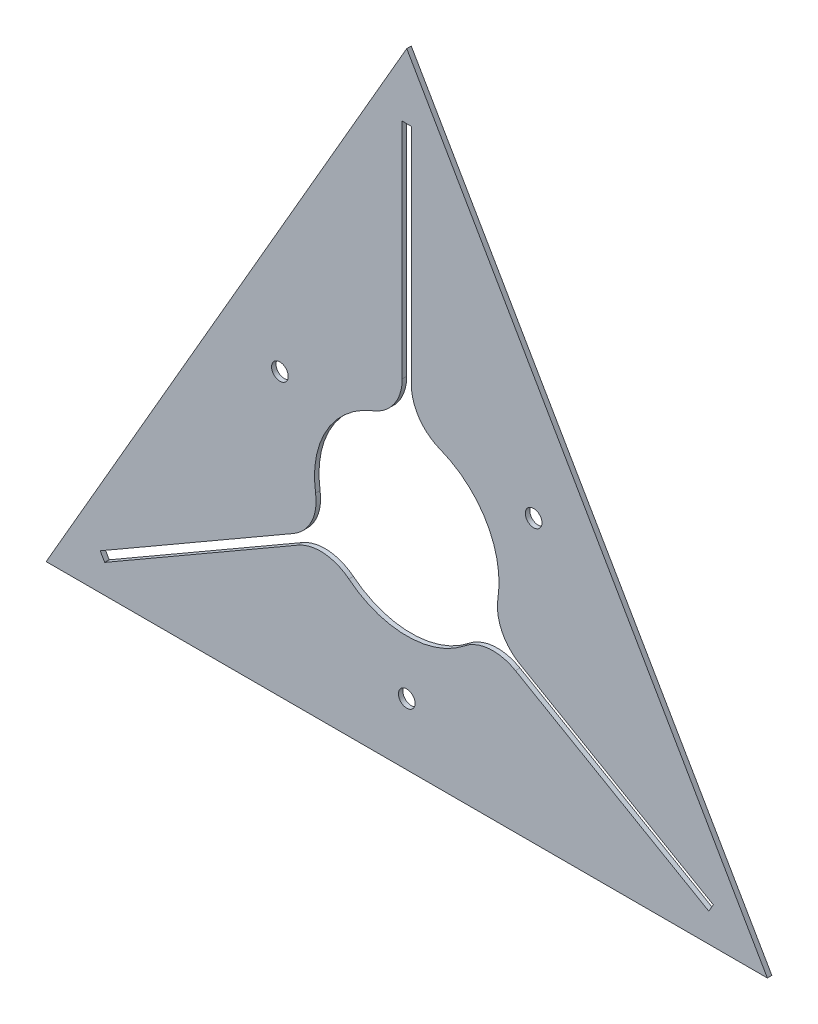
ISO-10303-21;
HEADER;
FILE_DESCRIPTION(('STEP AP214'),'2;1');
FILE_NAME('part.step','',(''),(''),'','','');
FILE_SCHEMA(('AUTOMOTIVE_DESIGN { 1 0 10303 214 1 1 1 1 }'));
ENDSEC;
DATA;
#1=APPLICATION_CONTEXT('core data for automotive mechanical design processes');
#2=APPLICATION_PROTOCOL_DEFINITION('international standard','automotive_design',2000,#1);
#3=PRODUCT_CONTEXT('',#1,'mechanical');
#4=PRODUCT('Part','Part','',(#3));
#5=PRODUCT_RELATED_PRODUCT_CATEGORY('part','',(#4));
#6=PRODUCT_DEFINITION_FORMATION('','',#4);
#7=PRODUCT_DEFINITION_CONTEXT('part definition',#1,'design');
#8=PRODUCT_DEFINITION('design','',#6,#7);
#9=PRODUCT_DEFINITION_SHAPE('','',#8);
#10=(LENGTH_UNIT() NAMED_UNIT(*) SI_UNIT(.MILLI.,.METRE.));
#11=(NAMED_UNIT(*) PLANE_ANGLE_UNIT() SI_UNIT($,.RADIAN.));
#12=(NAMED_UNIT(*) SI_UNIT($,.STERADIAN.) SOLID_ANGLE_UNIT());
#13=UNCERTAINTY_MEASURE_WITH_UNIT(LENGTH_MEASURE(1.E-05),#10,'distance_accuracy_value','');
#14=(GEOMETRIC_REPRESENTATION_CONTEXT(3) GLOBAL_UNCERTAINTY_ASSIGNED_CONTEXT((#13)) GLOBAL_UNIT_ASSIGNED_CONTEXT((#10,
#11,#12)) REPRESENTATION_CONTEXT('',''));
#15=CARTESIAN_POINT('',(0.,0.,0.));
#16=DIRECTION('',(0.,0.,1.));
#17=DIRECTION('',(1.,0.,0.));
#18=AXIS2_PLACEMENT_3D('',#15,#16,#17);
#19=CARTESIAN_POINT('',(0.,0.,2.54));
#20=DIRECTION('',(0.,0.,1.));
#21=DIRECTION('',(1.,0.,0.));
#22=AXIS2_PLACEMENT_3D('',#19,#20,#21);
#23=PLANE('',#22);
#24=CARTESIAN_POINT('',(-71.4903970824054,41.275,2.54));
#25=DIRECTION('',(0.,0.,1.));
#26=DIRECTION('',(1.,0.,0.));
#27=AXIS2_PLACEMENT_3D('',#24,#25,#26);
#28=CIRCLE('',#27,4.69899999999999);
#29=CARTESIAN_POINT('',(-66.7913970824054,41.275,2.54));
#30=VERTEX_POINT('',#29);
#31=EDGE_CURVE('E457',#30,#30,#28,.T.);
#32=ORIENTED_EDGE('',*,*,#31,.F.);
#33=EDGE_LOOP('',(#32));
#34=FACE_BOUND('',#33,.T.);
#35=DIRECTION('',(0.,-1.,0.));
#36=VECTOR('',#35,1.);
#37=CARTESIAN_POINT('',(-2.53999999999989,72.1881059610931,2.54));
#38=LINE('',#37,#36);
#39=CARTESIAN_POINT('',(-2.54,197.994436104842,2.54));
#40=VERTEX_POINT('',#39);
#41=CARTESIAN_POINT('',(-2.53999999999989,72.1881059610931,2.54));
#42=VERTEX_POINT('',#41);
#43=EDGE_CURVE('E188',#40,#42,#38,.T.);
#44=ORIENTED_EDGE('',*,*,#43,.F.);
#45=DIRECTION('',(-1.,0.,0.));
#46=VECTOR('',#45,1.);
#47=CARTESIAN_POINT('',(-2.54,197.994436104842,2.54));
#48=LINE('',#47,#46);
#49=CARTESIAN_POINT('',(2.54,197.994436104842,2.54));
#50=VERTEX_POINT('',#49);
#51=EDGE_CURVE('E180',#50,#40,#48,.T.);
#52=ORIENTED_EDGE('',*,*,#51,.F.);
#53=DIRECTION('',(0.,1.,0.));
#54=VECTOR('',#53,1.);
#55=CARTESIAN_POINT('',(2.53999999999989,72.1881059610931,2.54));
#56=LINE('',#55,#54);
#57=CARTESIAN_POINT('',(2.53999999999989,72.1881059610931,2.54));
#58=VERTEX_POINT('',#57);
#59=EDGE_CURVE('E235',#58,#50,#56,.T.);
#60=ORIENTED_EDGE('',*,*,#59,.F.);
#61=CARTESIAN_POINT('',(27.9399999999999,72.1881059610931,2.54));
#62=DIRECTION('',(0.,0.,-1.));
#63=DIRECTION('',(1.,0.,0.));
#64=AXIS2_PLACEMENT_3D('',#61,#62,#63);
#65=CIRCLE('',#64,25.4);
#66=CARTESIAN_POINT('',(18.7718293683346,48.5004583938763,2.54));
#67=VERTEX_POINT('',#66);
#68=EDGE_CURVE('E233',#67,#58,#65,.T.);
#69=ORIENTED_EDGE('',*,*,#68,.F.);
#70=CARTESIAN_POINT('',(0.,0.,2.54));
#71=DIRECTION('',(0.,0.,1.));
#72=DIRECTION('',(1.,0.,0.));
#73=AXIS2_PLACEMENT_3D('',#70,#71,#72);
#74=CIRCLE('',#73,52.0065);
#75=CARTESIAN_POINT('',(51.3885437484545,-7.9933480884536,2.54));
#76=VERTEX_POINT('',#75);
#77=EDGE_CURVE('E231',#76,#67,#74,.T.);
#78=ORIENTED_EDGE('',*,*,#77,.F.);
#79=CARTESIAN_POINT('',(76.4867336133894,-11.8973031988095,2.54));
#80=DIRECTION('',(0.,0.,-1.));
#81=DIRECTION('',(1.,0.,0.));
#82=AXIS2_PLACEMENT_3D('',#79,#80,#81);
#83=CIRCLE('',#82,25.4);
#84=CARTESIAN_POINT('',(63.7867336133895,-33.8943484549342,2.54));
#85=VERTEX_POINT('',#84);
#86=EDGE_CURVE('E229',#85,#76,#83,.T.);
#87=ORIENTED_EDGE('',*,*,#86,.F.);
#88=DIRECTION('',(-0.866025403784439,0.499999999999999,0.));
#89=VECTOR('',#88,1.);
#90=CARTESIAN_POINT('',(63.7867336133895,-33.8943484549342,2.54));
#91=LINE('',#90,#89);
#92=CARTESIAN_POINT('',(172.738211474768,-96.7975135268084,2.54));
#93=VERTEX_POINT('',#92);
#94=EDGE_CURVE('E227',#93,#85,#91,.T.);
#95=ORIENTED_EDGE('',*,*,#94,.F.);
#96=DIRECTION('',(0.500000000000002,0.866025403784437,0.));
#97=VECTOR('',#96,1.);
#98=CARTESIAN_POINT('',(172.738211474768,-96.7975135268084,2.54));
#99=LINE('',#98,#97);
#100=CARTESIAN_POINT('',(170.198211474768,-101.196922578033,2.54));
#101=VERTEX_POINT('',#100);
#102=EDGE_CURVE('E225',#101,#93,#99,.T.);
#103=ORIENTED_EDGE('',*,*,#102,.F.);
#104=DIRECTION('',(0.866025403784438,-0.5,0.));
#105=VECTOR('',#104,1.);
#106=CARTESIAN_POINT('',(61.2467336133896,-38.2937575061589,2.54));
#107=LINE('',#106,#105);
#108=CARTESIAN_POINT('',(61.2467336133896,-38.2937575061589,2.54));
#109=VERTEX_POINT('',#108);
#110=EDGE_CURVE('E223',#109,#101,#107,.T.);
#111=ORIENTED_EDGE('',*,*,#110,.F.);
#112=CARTESIAN_POINT('',(48.5467336133896,-60.2908027622836,2.54));
#113=DIRECTION('',(0.,0.,-1.));
#114=DIRECTION('',(1.,0.,0.));
#115=AXIS2_PLACEMENT_3D('',#112,#113,#114);
#116=CIRCLE('',#115,25.4);
#117=CARTESIAN_POINT('',(32.6167143801198,-40.5071103054227,2.54));
#118=VERTEX_POINT('',#117);
#119=EDGE_CURVE('E221',#118,#109,#116,.T.);
#120=ORIENTED_EDGE('',*,*,#119,.F.);
#121=CARTESIAN_POINT('',(0.,0.,2.54));
#122=DIRECTION('',(0.,0.,1.));
#123=DIRECTION('',(1.,0.,0.));
#124=AXIS2_PLACEMENT_3D('',#121,#122,#123);
#125=CIRCLE('',#124,52.0065);
#126=CARTESIAN_POINT('',(-32.6167143801198,-40.5071103054228,2.54));
#127=VERTEX_POINT('',#126);
#128=EDGE_CURVE('E219',#127,#118,#125,.T.);
#129=ORIENTED_EDGE('',*,*,#128,.F.);
#130=CARTESIAN_POINT('',(-48.5467336133896,-60.2908027622837,2.54));
#131=DIRECTION('',(0.,0.,-1.));
#132=DIRECTION('',(1.,0.,0.));
#133=AXIS2_PLACEMENT_3D('',#130,#131,#132);
#134=CIRCLE('',#133,25.4);
#135=CARTESIAN_POINT('',(-61.2467336133896,-38.293757506159,2.54));
#136=VERTEX_POINT('',#135);
#137=EDGE_CURVE('E217',#136,#127,#134,.T.);
#138=ORIENTED_EDGE('',*,*,#137,.F.);
#139=DIRECTION('',(0.866025403784438,0.500000000000001,0.));
#140=VECTOR('',#139,1.);
#141=CARTESIAN_POINT('',(-61.2467336133896,-38.293757506159,2.54));
#142=LINE('',#141,#140);
#143=CARTESIAN_POINT('',(-170.198211474768,-101.196922578034,2.54));
#144=VERTEX_POINT('',#143);
#145=EDGE_CURVE('E215',#144,#136,#142,.T.);
#146=ORIENTED_EDGE('',*,*,#145,.F.);
#147=DIRECTION('',(0.500000000000002,-0.866025403784438,0.));
#148=VECTOR('',#147,1.);
#149=CARTESIAN_POINT('',(-170.198211474768,-101.196922578034,2.54));
#150=LINE('',#149,#148);
#151=CARTESIAN_POINT('',(-172.738211474768,-96.7975135268086,2.54));
#152=VERTEX_POINT('',#151);
#153=EDGE_CURVE('E213',#152,#144,#150,.T.);
#154=ORIENTED_EDGE('',*,*,#153,.F.);
#155=DIRECTION('',(-0.866025403784439,-0.5,0.));
#156=VECTOR('',#155,1.);
#157=CARTESIAN_POINT('',(-63.7867336133895,-33.8943484549342,2.54));
#158=LINE('',#157,#156);
#159=CARTESIAN_POINT('',(-63.7867336133895,-33.8943484549342,2.54));
#160=VERTEX_POINT('',#159);
#161=EDGE_CURVE('E211',#160,#152,#158,.T.);
#162=ORIENTED_EDGE('',*,*,#161,.F.);
#163=CARTESIAN_POINT('',(-76.4867336133894,-11.8973031988095,2.54));
#164=DIRECTION('',(0.,0.,-1.));
#165=DIRECTION('',(1.,0.,0.));
#166=AXIS2_PLACEMENT_3D('',#163,#164,#165);
#167=CIRCLE('',#166,25.4);
#168=CARTESIAN_POINT('',(-51.3885437484544,-7.99334808845362,2.54));
#169=VERTEX_POINT('',#168);
#170=EDGE_CURVE('E209',#169,#160,#167,.T.);
#171=ORIENTED_EDGE('',*,*,#170,.F.);
#172=CARTESIAN_POINT('',(0.,0.,2.54));
#173=DIRECTION('',(0.,0.,1.));
#174=DIRECTION('',(1.,0.,0.));
#175=AXIS2_PLACEMENT_3D('',#172,#173,#174);
#176=CIRCLE('',#175,52.0065);
#177=CARTESIAN_POINT('',(-18.7718293683346,48.5004583938764,2.54));
#178=VERTEX_POINT('',#177);
#179=EDGE_CURVE('E204',#178,#169,#176,.T.);
#180=ORIENTED_EDGE('',*,*,#179,.F.);
#181=CARTESIAN_POINT('',(-27.9399999999999,72.1881059610931,2.54));
#182=DIRECTION('',(0.,0.,-1.));
#183=DIRECTION('',(1.,0.,0.));
#184=AXIS2_PLACEMENT_3D('',#181,#182,#183);
#185=CIRCLE('',#184,25.4);
#186=EDGE_CURVE('E202',#42,#178,#185,.T.);
#187=ORIENTED_EDGE('',*,*,#186,.F.);
#188=EDGE_LOOP('',(#44,#52,#60,#69,#78,#87,#95,#103,#111,#120,#129,#138,#146,#154,#162,#171,
#180,#187));
#189=FACE_BOUND('',#188,.T.);
#190=DIRECTION('',(-0.5,0.866025403784439,0.));
#191=VECTOR('',#190,1.);
#192=CARTESIAN_POINT('',(203.2,-117.317574699332,2.54));
#193=LINE('',#192,#191);
#194=CARTESIAN_POINT('',(203.2,-117.317574699332,2.54));
#195=VERTEX_POINT('',#194);
#196=CARTESIAN_POINT('',(1.11022302462516E-13,234.635149398664,2.54));
#197=VERTEX_POINT('',#196);
#198=EDGE_CURVE('E318',#195,#197,#193,.T.);
#199=ORIENTED_EDGE('',*,*,#198,.T.);
#200=DIRECTION('',(-0.5,-0.866025403784438,0.));
#201=VECTOR('',#200,1.);
#202=CARTESIAN_POINT('',(1.11022302462516E-13,234.635149398664,2.54));
#203=LINE('',#202,#201);
#204=CARTESIAN_POINT('',(-203.2,-117.317574699332,2.54));
#205=VERTEX_POINT('',#204);
#206=EDGE_CURVE('E321',#197,#205,#203,.T.);
#207=ORIENTED_EDGE('',*,*,#206,.T.);
#208=DIRECTION('',(1.,0.,0.));
#209=VECTOR('',#208,1.);
#210=CARTESIAN_POINT('',(-203.2,-117.317574699332,2.54));
#211=LINE('',#210,#209);
#212=EDGE_CURVE('E324',#205,#195,#211,.T.);
#213=ORIENTED_EDGE('',*,*,#212,.T.);
#214=EDGE_LOOP('',(#199,#207,#213));
#215=FACE_BOUND('',#214,.T.);
#216=CARTESIAN_POINT('',(0.,-82.55,2.54));
#217=DIRECTION('',(0.,0.,1.));
#218=DIRECTION('',(1.,0.,0.));
#219=AXIS2_PLACEMENT_3D('',#216,#217,#218);
#220=CIRCLE('',#219,4.699);
#221=CARTESIAN_POINT('',(4.699,-82.55,2.54));
#222=VERTEX_POINT('',#221);
#223=EDGE_CURVE('E238',#222,#222,#220,.T.);
#224=ORIENTED_EDGE('',*,*,#223,.F.);
#225=EDGE_LOOP('',(#224));
#226=FACE_BOUND('',#225,.T.);
#227=CARTESIAN_POINT('',(71.4903970824054,41.275,2.54));
#228=DIRECTION('',(0.,0.,1.));
#229=DIRECTION('',(1.,0.,0.));
#230=AXIS2_PLACEMENT_3D('',#227,#228,#229);
#231=CIRCLE('',#230,4.69899999999999);
#232=CARTESIAN_POINT('',(76.1893970824054,41.275,2.54));
#233=VERTEX_POINT('',#232);
#234=EDGE_CURVE('E448',#233,#233,#231,.T.);
#235=ORIENTED_EDGE('',*,*,#234,.F.);
#236=EDGE_LOOP('',(#235));
#237=FACE_BOUND('',#236,.T.);
#238=ADVANCED_FACE('F37',(#34,#189,#215,#226,#237),#23,.T.);
#239=CARTESIAN_POINT('',(0.,0.,0.));
#240=DIRECTION('',(0.,0.,1.));
#241=DIRECTION('',(1.,0.,0.));
#242=AXIS2_PLACEMENT_3D('',#239,#240,#241);
#243=PLANE('',#242);
#244=DIRECTION('',(-0.5,0.866025403784439,0.));
#245=VECTOR('',#244,1.);
#246=CARTESIAN_POINT('',(203.2,-117.317574699332,0.));
#247=LINE('',#246,#245);
#248=CARTESIAN_POINT('',(203.2,-117.317574699332,0.));
#249=VERTEX_POINT('',#248);
#250=CARTESIAN_POINT('',(1.11022302462516E-13,234.635149398664,0.));
#251=VERTEX_POINT('',#250);
#252=EDGE_CURVE('E196',#249,#251,#247,.T.);
#253=ORIENTED_EDGE('',*,*,#252,.F.);
#254=DIRECTION('',(1.,0.,0.));
#255=VECTOR('',#254,1.);
#256=CARTESIAN_POINT('',(-203.2,-117.317574699332,0.));
#257=LINE('',#256,#255);
#258=CARTESIAN_POINT('',(-203.2,-117.317574699332,0.));
#259=VERTEX_POINT('',#258);
#260=EDGE_CURVE('E322',#259,#249,#257,.T.);
#261=ORIENTED_EDGE('',*,*,#260,.F.);
#262=DIRECTION('',(-0.5,-0.866025403784438,0.));
#263=VECTOR('',#262,1.);
#264=CARTESIAN_POINT('',(1.11022302462516E-13,234.635149398664,0.));
#265=LINE('',#264,#263);
#266=EDGE_CURVE('E329',#251,#259,#265,.T.);
#267=ORIENTED_EDGE('',*,*,#266,.F.);
#268=EDGE_LOOP('',(#253,#261,#267));
#269=FACE_BOUND('',#268,.T.);
#270=DIRECTION('',(-1.,0.,0.));
#271=VECTOR('',#270,1.);
#272=CARTESIAN_POINT('',(-2.54,197.994436104842,0.));
#273=LINE('',#272,#271);
#274=CARTESIAN_POINT('',(2.54,197.994436104842,0.));
#275=VERTEX_POINT('',#274);
#276=CARTESIAN_POINT('',(-2.54,197.994436104842,0.));
#277=VERTEX_POINT('',#276);
#278=EDGE_CURVE('E60',#275,#277,#273,.T.);
#279=ORIENTED_EDGE('',*,*,#278,.T.);
#280=DIRECTION('',(0.,-1.,0.));
#281=VECTOR('',#280,1.);
#282=CARTESIAN_POINT('',(-2.53999999999989,72.1881059610931,0.));
#283=LINE('',#282,#281);
#284=CARTESIAN_POINT('',(-2.53999999999989,72.1881059610931,0.));
#285=VERTEX_POINT('',#284);
#286=EDGE_CURVE('E195',#277,#285,#283,.T.);
#287=ORIENTED_EDGE('',*,*,#286,.T.);
#288=CARTESIAN_POINT('',(-27.9399999999999,72.1881059610931,0.));
#289=DIRECTION('',(0.,0.,-1.));
#290=DIRECTION('',(1.,0.,0.));
#291=AXIS2_PLACEMENT_3D('',#288,#289,#290);
#292=CIRCLE('',#291,25.4);
#293=CARTESIAN_POINT('',(-18.7718293683346,48.5004583938764,0.));
#294=VERTEX_POINT('',#293);
#295=EDGE_CURVE('E240',#285,#294,#292,.T.);
#296=ORIENTED_EDGE('',*,*,#295,.T.);
#297=CARTESIAN_POINT('',(0.,0.,0.));
#298=DIRECTION('',(0.,0.,1.));
#299=DIRECTION('',(1.,0.,0.));
#300=AXIS2_PLACEMENT_3D('',#297,#298,#299);
#301=CIRCLE('',#300,52.0065);
#302=CARTESIAN_POINT('',(-51.3885437484544,-7.99334808845362,0.));
#303=VERTEX_POINT('',#302);
#304=EDGE_CURVE('E243',#294,#303,#301,.T.);
#305=ORIENTED_EDGE('',*,*,#304,.T.);
#306=CARTESIAN_POINT('',(-76.4867336133894,-11.8973031988095,0.));
#307=DIRECTION('',(0.,0.,-1.));
#308=DIRECTION('',(1.,0.,0.));
#309=AXIS2_PLACEMENT_3D('',#306,#307,#308);
#310=CIRCLE('',#309,25.4);
#311=CARTESIAN_POINT('',(-63.7867336133895,-33.8943484549342,0.));
#312=VERTEX_POINT('',#311);
#313=EDGE_CURVE('E246',#303,#312,#310,.T.);
#314=ORIENTED_EDGE('',*,*,#313,.T.);
#315=DIRECTION('',(-0.866025403784439,-0.5,0.));
#316=VECTOR('',#315,1.);
#317=CARTESIAN_POINT('',(-63.7867336133895,-33.8943484549342,0.));
#318=LINE('',#317,#316);
#319=CARTESIAN_POINT('',(-172.738211474768,-96.7975135268086,0.));
#320=VERTEX_POINT('',#319);
#321=EDGE_CURVE('E249',#312,#320,#318,.T.);
#322=ORIENTED_EDGE('',*,*,#321,.T.);
#323=DIRECTION('',(0.500000000000002,-0.866025403784438,0.));
#324=VECTOR('',#323,1.);
#325=CARTESIAN_POINT('',(-170.198211474768,-101.196922578034,0.));
#326=LINE('',#325,#324);
#327=CARTESIAN_POINT('',(-170.198211474768,-101.196922578034,0.));
#328=VERTEX_POINT('',#327);
#329=EDGE_CURVE('E252',#320,#328,#326,.T.);
#330=ORIENTED_EDGE('',*,*,#329,.T.);
#331=DIRECTION('',(0.866025403784438,0.500000000000001,0.));
#332=VECTOR('',#331,1.);
#333=CARTESIAN_POINT('',(-61.2467336133896,-38.293757506159,0.));
#334=LINE('',#333,#332);
#335=CARTESIAN_POINT('',(-61.2467336133896,-38.293757506159,0.));
#336=VERTEX_POINT('',#335);
#337=EDGE_CURVE('E255',#328,#336,#334,.T.);
#338=ORIENTED_EDGE('',*,*,#337,.T.);
#339=CARTESIAN_POINT('',(-48.5467336133896,-60.2908027622837,0.));
#340=DIRECTION('',(0.,0.,-1.));
#341=DIRECTION('',(1.,0.,0.));
#342=AXIS2_PLACEMENT_3D('',#339,#340,#341);
#343=CIRCLE('',#342,25.4);
#344=CARTESIAN_POINT('',(-32.6167143801198,-40.5071103054228,0.));
#345=VERTEX_POINT('',#344);
#346=EDGE_CURVE('E258',#336,#345,#343,.T.);
#347=ORIENTED_EDGE('',*,*,#346,.T.);
#348=CARTESIAN_POINT('',(0.,0.,0.));
#349=DIRECTION('',(0.,0.,1.));
#350=DIRECTION('',(1.,0.,0.));
#351=AXIS2_PLACEMENT_3D('',#348,#349,#350);
#352=CIRCLE('',#351,52.0065);
#353=CARTESIAN_POINT('',(32.6167143801198,-40.5071103054227,0.));
#354=VERTEX_POINT('',#353);
#355=EDGE_CURVE('E261',#345,#354,#352,.T.);
#356=ORIENTED_EDGE('',*,*,#355,.T.);
#357=CARTESIAN_POINT('',(48.5467336133896,-60.2908027622836,0.));
#358=DIRECTION('',(0.,0.,-1.));
#359=DIRECTION('',(1.,0.,0.));
#360=AXIS2_PLACEMENT_3D('',#357,#358,#359);
#361=CIRCLE('',#360,25.4);
#362=CARTESIAN_POINT('',(61.2467336133896,-38.2937575061589,0.));
#363=VERTEX_POINT('',#362);
#364=EDGE_CURVE('E264',#354,#363,#361,.T.);
#365=ORIENTED_EDGE('',*,*,#364,.T.);
#366=DIRECTION('',(0.866025403784438,-0.5,0.));
#367=VECTOR('',#366,1.);
#368=CARTESIAN_POINT('',(61.2467336133896,-38.2937575061589,0.));
#369=LINE('',#368,#367);
#370=CARTESIAN_POINT('',(170.198211474768,-101.196922578033,0.));
#371=VERTEX_POINT('',#370);
#372=EDGE_CURVE('E267',#363,#371,#369,.T.);
#373=ORIENTED_EDGE('',*,*,#372,.T.);
#374=DIRECTION('',(0.500000000000002,0.866025403784437,0.));
#375=VECTOR('',#374,1.);
#376=CARTESIAN_POINT('',(172.738211474768,-96.7975135268084,0.));
#377=LINE('',#376,#375);
#378=CARTESIAN_POINT('',(172.738211474768,-96.7975135268084,0.));
#379=VERTEX_POINT('',#378);
#380=EDGE_CURVE('E270',#371,#379,#377,.T.);
#381=ORIENTED_EDGE('',*,*,#380,.T.);
#382=DIRECTION('',(-0.866025403784439,0.499999999999999,0.));
#383=VECTOR('',#382,1.);
#384=CARTESIAN_POINT('',(63.7867336133895,-33.8943484549342,0.));
#385=LINE('',#384,#383);
#386=CARTESIAN_POINT('',(63.7867336133895,-33.8943484549342,0.));
#387=VERTEX_POINT('',#386);
#388=EDGE_CURVE('E273',#379,#387,#385,.T.);
#389=ORIENTED_EDGE('',*,*,#388,.T.);
#390=CARTESIAN_POINT('',(76.4867336133894,-11.8973031988095,0.));
#391=DIRECTION('',(0.,0.,-1.));
#392=DIRECTION('',(1.,0.,0.));
#393=AXIS2_PLACEMENT_3D('',#390,#391,#392);
#394=CIRCLE('',#393,25.4);
#395=CARTESIAN_POINT('',(51.3885437484545,-7.9933480884536,0.));
#396=VERTEX_POINT('',#395);
#397=EDGE_CURVE('E276',#387,#396,#394,.T.);
#398=ORIENTED_EDGE('',*,*,#397,.T.);
#399=CARTESIAN_POINT('',(0.,0.,0.));
#400=DIRECTION('',(0.,0.,1.));
#401=DIRECTION('',(1.,0.,0.));
#402=AXIS2_PLACEMENT_3D('',#399,#400,#401);
#403=CIRCLE('',#402,52.0065);
#404=CARTESIAN_POINT('',(18.7718293683346,48.5004583938763,0.));
#405=VERTEX_POINT('',#404);
#406=EDGE_CURVE('E279',#396,#405,#403,.T.);
#407=ORIENTED_EDGE('',*,*,#406,.T.);
#408=CARTESIAN_POINT('',(27.9399999999999,72.1881059610931,0.));
#409=DIRECTION('',(0.,0.,-1.));
#410=DIRECTION('',(1.,0.,0.));
#411=AXIS2_PLACEMENT_3D('',#408,#409,#410);
#412=CIRCLE('',#411,25.4);
#413=CARTESIAN_POINT('',(2.53999999999988,72.1881059610931,0.));
#414=VERTEX_POINT('',#413);
#415=EDGE_CURVE('E282',#405,#414,#412,.T.);
#416=ORIENTED_EDGE('',*,*,#415,.T.);
#417=DIRECTION('',(0.,1.,0.));
#418=VECTOR('',#417,1.);
#419=CARTESIAN_POINT('',(2.53999999999989,72.1881059610931,0.));
#420=LINE('',#419,#418);
#421=EDGE_CURVE('E189',#414,#275,#420,.T.);
#422=ORIENTED_EDGE('',*,*,#421,.T.);
#423=EDGE_LOOP('',(#279,#287,#296,#305,#314,#322,#330,#338,#347,#356,#365,#373,#381,#389,#398,
#407,#416,#422));
#424=FACE_BOUND('',#423,.T.);
#425=CARTESIAN_POINT('',(0.,-82.55,0.));
#426=DIRECTION('',(0.,0.,1.));
#427=DIRECTION('',(1.,0.,0.));
#428=AXIS2_PLACEMENT_3D('',#425,#426,#427);
#429=CIRCLE('',#428,4.699);
#430=CARTESIAN_POINT('',(4.699,-82.55,0.));
#431=VERTEX_POINT('',#430);
#432=EDGE_CURVE('E460',#431,#431,#429,.T.);
#433=ORIENTED_EDGE('',*,*,#432,.T.);
#434=EDGE_LOOP('',(#433));
#435=FACE_BOUND('',#434,.T.);
#436=CARTESIAN_POINT('',(-71.4903970824054,41.275,0.));
#437=DIRECTION('',(0.,0.,1.));
#438=DIRECTION('',(1.,0.,0.));
#439=AXIS2_PLACEMENT_3D('',#436,#437,#438);
#440=CIRCLE('',#439,4.69899999999999);
#441=CARTESIAN_POINT('',(-66.7913970824054,41.275,0.));
#442=VERTEX_POINT('',#441);
#443=EDGE_CURVE('E454',#442,#442,#440,.T.);
#444=ORIENTED_EDGE('',*,*,#443,.T.);
#445=EDGE_LOOP('',(#444));
#446=FACE_BOUND('',#445,.T.);
#447=CARTESIAN_POINT('',(71.4903970824054,41.275,0.));
#448=DIRECTION('',(0.,0.,1.));
#449=DIRECTION('',(1.,0.,0.));
#450=AXIS2_PLACEMENT_3D('',#447,#448,#449);
#451=CIRCLE('',#450,4.69899999999999);
#452=CARTESIAN_POINT('',(76.1893970824054,41.275,0.));
#453=VERTEX_POINT('',#452);
#454=EDGE_CURVE('E451',#453,#453,#451,.T.);
#455=ORIENTED_EDGE('',*,*,#454,.T.);
#456=EDGE_LOOP('',(#455));
#457=FACE_BOUND('',#456,.T.);
#458=ADVANCED_FACE('F343',(#269,#424,#435,#446,#457),#243,.F.);
#459=CARTESIAN_POINT('',(203.2,-117.317574699332,2.54));
#460=DIRECTION('',(-0.866025403784439,-0.5,0.));
#461=DIRECTION('',(0.5,-0.866025403784439,0.));
#462=AXIS2_PLACEMENT_3D('',#459,#460,#461);
#463=PLANE('',#462);
#464=ORIENTED_EDGE('',*,*,#252,.T.);
#465=DIRECTION('',(0.,0.,-1.));
#466=VECTOR('',#465,1.);
#467=CARTESIAN_POINT('',(1.11022302462516E-13,234.635149398664,2.54));
#468=LINE('',#467,#466);
#469=EDGE_CURVE('E11',#197,#251,#468,.T.);
#470=ORIENTED_EDGE('',*,*,#469,.F.);
#471=ORIENTED_EDGE('',*,*,#198,.F.);
#472=DIRECTION('',(0.,0.,-1.));
#473=VECTOR('',#472,1.);
#474=CARTESIAN_POINT('',(203.2,-117.317574699332,2.54));
#475=LINE('',#474,#473);
#476=EDGE_CURVE('E326',#195,#249,#475,.T.);
#477=ORIENTED_EDGE('',*,*,#476,.T.);
#478=EDGE_LOOP('',(#464,#470,#471,#477));
#479=FACE_BOUND('',#478,.T.);
#480=ADVANCED_FACE('F39',(#479),#463,.F.);
#481=CARTESIAN_POINT('',(1.11022302462516E-13,234.635149398664,2.54));
#482=DIRECTION('',(0.866025403784438,-0.5,0.));
#483=DIRECTION('',(0.5,0.866025403784439,0.));
#484=AXIS2_PLACEMENT_3D('',#481,#482,#483);
#485=PLANE('',#484);
#486=ORIENTED_EDGE('',*,*,#266,.T.);
#487=DIRECTION('',(0.,0.,-1.));
#488=VECTOR('',#487,1.);
#489=CARTESIAN_POINT('',(-203.2,-117.317574699332,2.54));
#490=LINE('',#489,#488);
#491=EDGE_CURVE('E45',#205,#259,#490,.T.);
#492=ORIENTED_EDGE('',*,*,#491,.F.);
#493=ORIENTED_EDGE('',*,*,#206,.F.);
#494=ORIENTED_EDGE('',*,*,#469,.T.);
#495=EDGE_LOOP('',(#486,#492,#493,#494));
#496=FACE_BOUND('',#495,.T.);
#497=ADVANCED_FACE('F349',(#496),#485,.F.);
#498=CARTESIAN_POINT('',(-203.2,-117.317574699332,2.54));
#499=DIRECTION('',(0.,1.,0.));
#500=DIRECTION('',(-1.,0.,0.));
#501=AXIS2_PLACEMENT_3D('',#498,#499,#500);
#502=PLANE('',#501);
#503=ORIENTED_EDGE('',*,*,#260,.T.);
#504=ORIENTED_EDGE('',*,*,#476,.F.);
#505=ORIENTED_EDGE('',*,*,#212,.F.);
#506=ORIENTED_EDGE('',*,*,#491,.T.);
#507=EDGE_LOOP('',(#503,#504,#505,#506));
#508=FACE_BOUND('',#507,.T.);
#509=ADVANCED_FACE('F338',(#508),#502,.F.);
#510=CARTESIAN_POINT('',(-2.54,197.994436104842,2.54));
#511=DIRECTION('',(0.,-1.,0.));
#512=DIRECTION('',(0.,0.,-1.));
#513=AXIS2_PLACEMENT_3D('',#510,#511,#512);
#514=PLANE('',#513);
#515=ORIENTED_EDGE('',*,*,#278,.F.);
#516=DIRECTION('',(0.,0.,-1.));
#517=VECTOR('',#516,1.);
#518=CARTESIAN_POINT('',(2.54,197.994436104842,2.54));
#519=LINE('',#518,#517);
#520=EDGE_CURVE('E184',#50,#275,#519,.T.);
#521=ORIENTED_EDGE('',*,*,#520,.F.);
#522=ORIENTED_EDGE('',*,*,#51,.T.);
#523=DIRECTION('',(0.,0.,-1.));
#524=VECTOR('',#523,1.);
#525=CARTESIAN_POINT('',(-2.54,197.994436104842,2.54));
#526=LINE('',#525,#524);
#527=EDGE_CURVE('E183',#40,#277,#526,.T.);
#528=ORIENTED_EDGE('',*,*,#527,.T.);
#529=EDGE_LOOP('',(#515,#521,#522,#528));
#530=FACE_BOUND('',#529,.T.);
#531=ADVANCED_FACE('F182',(#530),#514,.T.);
#532=CARTESIAN_POINT('',(-2.53999999999989,72.1881059610931,2.54));
#533=DIRECTION('',(1.,0.,0.));
#534=DIRECTION('',(0.,1.,0.));
#535=AXIS2_PLACEMENT_3D('',#532,#533,#534);
#536=PLANE('',#535);
#537=ORIENTED_EDGE('',*,*,#286,.F.);
#538=ORIENTED_EDGE('',*,*,#527,.F.);
#539=ORIENTED_EDGE('',*,*,#43,.T.);
#540=DIRECTION('',(0.,0.,-1.));
#541=VECTOR('',#540,1.);
#542=CARTESIAN_POINT('',(-2.53999999999989,72.1881059610931,2.54));
#543=LINE('',#542,#541);
#544=EDGE_CURVE('E197',#42,#285,#543,.T.);
#545=ORIENTED_EDGE('',*,*,#544,.T.);
#546=EDGE_LOOP('',(#537,#538,#539,#545));
#547=FACE_BOUND('',#546,.T.);
#548=ADVANCED_FACE('F192',(#547),#536,.T.);
#549=CARTESIAN_POINT('',(-27.9399999999999,72.1881059610931,2.54));
#550=DIRECTION('',(0.,0.,-1.));
#551=DIRECTION('',(-1.,0.,0.));
#552=AXIS2_PLACEMENT_3D('',#549,#550,#551);
#553=CYLINDRICAL_SURFACE('',#552,25.4);
#554=ORIENTED_EDGE('',*,*,#295,.F.);
#555=ORIENTED_EDGE('',*,*,#544,.F.);
#556=ORIENTED_EDGE('',*,*,#186,.T.);
#557=DIRECTION('',(0.,0.,-1.));
#558=VECTOR('',#557,1.);
#559=CARTESIAN_POINT('',(-18.7718293683346,48.5004583938764,2.54));
#560=LINE('',#559,#558);
#561=EDGE_CURVE('E315',#178,#294,#560,.T.);
#562=ORIENTED_EDGE('',*,*,#561,.T.);
#563=EDGE_LOOP('',(#554,#555,#556,#562));
#564=FACE_BOUND('',#563,.T.);
#565=ADVANCED_FACE('F369',(#564),#553,.T.);
#566=CARTESIAN_POINT('',(0.,0.,2.54));
#567=DIRECTION('',(0.,0.,-1.));
#568=DIRECTION('',(-1.,0.,0.));
#569=AXIS2_PLACEMENT_3D('',#566,#567,#568);
#570=CYLINDRICAL_SURFACE('',#569,52.0065);
#571=ORIENTED_EDGE('',*,*,#304,.F.);
#572=ORIENTED_EDGE('',*,*,#561,.F.);
#573=ORIENTED_EDGE('',*,*,#179,.T.);
#574=DIRECTION('',(0.,0.,-1.));
#575=VECTOR('',#574,1.);
#576=CARTESIAN_POINT('',(-51.3885437484544,-7.99334808845362,2.54));
#577=LINE('',#576,#575);
#578=EDGE_CURVE('E313',#169,#303,#577,.T.);
#579=ORIENTED_EDGE('',*,*,#578,.T.);
#580=EDGE_LOOP('',(#571,#572,#573,#579));
#581=FACE_BOUND('',#580,.T.);
#582=ADVANCED_FACE('F372',(#581),#570,.F.);
#583=CARTESIAN_POINT('',(-76.4867336133894,-11.8973031988095,2.54));
#584=DIRECTION('',(0.,0.,-1.));
#585=DIRECTION('',(-1.,0.,0.));
#586=AXIS2_PLACEMENT_3D('',#583,#584,#585);
#587=CYLINDRICAL_SURFACE('',#586,25.4);
#588=ORIENTED_EDGE('',*,*,#313,.F.);
#589=ORIENTED_EDGE('',*,*,#578,.F.);
#590=ORIENTED_EDGE('',*,*,#170,.T.);
#591=DIRECTION('',(0.,0.,-1.));
#592=VECTOR('',#591,1.);
#593=CARTESIAN_POINT('',(-63.7867336133895,-33.8943484549342,2.54));
#594=LINE('',#593,#592);
#595=EDGE_CURVE('E311',#160,#312,#594,.T.);
#596=ORIENTED_EDGE('',*,*,#595,.T.);
#597=EDGE_LOOP('',(#588,#589,#590,#596));
#598=FACE_BOUND('',#597,.T.);
#599=ADVANCED_FACE('F376',(#598),#587,.T.);
#600=CARTESIAN_POINT('',(-63.7867336133895,-33.8943484549342,2.54));
#601=DIRECTION('',(0.5,-0.866025403784439,0.));
#602=DIRECTION('',(0.866025403784439,0.5,0.));
#603=AXIS2_PLACEMENT_3D('',#600,#601,#602);
#604=PLANE('',#603);
#605=ORIENTED_EDGE('',*,*,#321,.F.);
#606=ORIENTED_EDGE('',*,*,#595,.F.);
#607=ORIENTED_EDGE('',*,*,#161,.T.);
#608=DIRECTION('',(0.,0.,-1.));
#609=VECTOR('',#608,1.);
#610=CARTESIAN_POINT('',(-172.738211474768,-96.7975135268086,2.54));
#611=LINE('',#610,#609);
#612=EDGE_CURVE('E309',#152,#320,#611,.T.);
#613=ORIENTED_EDGE('',*,*,#612,.T.);
#614=EDGE_LOOP('',(#605,#606,#607,#613));
#615=FACE_BOUND('',#614,.T.);
#616=ADVANCED_FACE('F380',(#615),#604,.T.);
#617=CARTESIAN_POINT('',(-170.198211474768,-101.196922578034,2.54));
#618=DIRECTION('',(0.866025403784438,0.500000000000002,0.));
#619=DIRECTION('',(-0.500000000000002,0.866025403784438,0.));
#620=AXIS2_PLACEMENT_3D('',#617,#618,#619);
#621=PLANE('',#620);
#622=ORIENTED_EDGE('',*,*,#329,.F.);
#623=ORIENTED_EDGE('',*,*,#612,.F.);
#624=ORIENTED_EDGE('',*,*,#153,.T.);
#625=DIRECTION('',(0.,0.,-1.));
#626=VECTOR('',#625,1.);
#627=CARTESIAN_POINT('',(-170.198211474768,-101.196922578034,2.54));
#628=LINE('',#627,#626);
#629=EDGE_CURVE('E307',#144,#328,#628,.T.);
#630=ORIENTED_EDGE('',*,*,#629,.T.);
#631=EDGE_LOOP('',(#622,#623,#624,#630));
#632=FACE_BOUND('',#631,.T.);
#633=ADVANCED_FACE('F384',(#632),#621,.T.);
#634=CARTESIAN_POINT('',(-61.2467336133896,-38.293757506159,2.54));
#635=DIRECTION('',(-0.500000000000001,0.866025403784438,0.));
#636=DIRECTION('',(-0.866025403784438,-0.500000000000001,0.));
#637=AXIS2_PLACEMENT_3D('',#634,#635,#636);
#638=PLANE('',#637);
#639=ORIENTED_EDGE('',*,*,#337,.F.);
#640=ORIENTED_EDGE('',*,*,#629,.F.);
#641=ORIENTED_EDGE('',*,*,#145,.T.);
#642=DIRECTION('',(0.,0.,-1.));
#643=VECTOR('',#642,1.);
#644=CARTESIAN_POINT('',(-61.2467336133896,-38.293757506159,2.54));
#645=LINE('',#644,#643);
#646=EDGE_CURVE('E305',#136,#336,#645,.T.);
#647=ORIENTED_EDGE('',*,*,#646,.T.);
#648=EDGE_LOOP('',(#639,#640,#641,#647));
#649=FACE_BOUND('',#648,.T.);
#650=ADVANCED_FACE('F388',(#649),#638,.T.);
#651=CARTESIAN_POINT('',(-48.5467336133896,-60.2908027622837,2.54));
#652=DIRECTION('',(0.,0.,-1.));
#653=DIRECTION('',(-1.,0.,0.));
#654=AXIS2_PLACEMENT_3D('',#651,#652,#653);
#655=CYLINDRICAL_SURFACE('',#654,25.4);
#656=ORIENTED_EDGE('',*,*,#346,.F.);
#657=ORIENTED_EDGE('',*,*,#646,.F.);
#658=ORIENTED_EDGE('',*,*,#137,.T.);
#659=DIRECTION('',(0.,0.,-1.));
#660=VECTOR('',#659,1.);
#661=CARTESIAN_POINT('',(-32.6167143801198,-40.5071103054228,2.54));
#662=LINE('',#661,#660);
#663=EDGE_CURVE('E303',#127,#345,#662,.T.);
#664=ORIENTED_EDGE('',*,*,#663,.T.);
#665=EDGE_LOOP('',(#656,#657,#658,#664));
#666=FACE_BOUND('',#665,.T.);
#667=ADVANCED_FACE('F392',(#666),#655,.T.);
#668=CARTESIAN_POINT('',(0.,0.,2.54));
#669=DIRECTION('',(0.,0.,-1.));
#670=DIRECTION('',(-1.,0.,0.));
#671=AXIS2_PLACEMENT_3D('',#668,#669,#670);
#672=CYLINDRICAL_SURFACE('',#671,52.0065);
#673=ORIENTED_EDGE('',*,*,#355,.F.);
#674=ORIENTED_EDGE('',*,*,#663,.F.);
#675=ORIENTED_EDGE('',*,*,#128,.T.);
#676=DIRECTION('',(0.,0.,-1.));
#677=VECTOR('',#676,1.);
#678=CARTESIAN_POINT('',(32.6167143801198,-40.5071103054227,2.54));
#679=LINE('',#678,#677);
#680=EDGE_CURVE('E301',#118,#354,#679,.T.);
#681=ORIENTED_EDGE('',*,*,#680,.T.);
#682=EDGE_LOOP('',(#673,#674,#675,#681));
#683=FACE_BOUND('',#682,.T.);
#684=ADVANCED_FACE('F396',(#683),#672,.F.);
#685=CARTESIAN_POINT('',(48.5467336133896,-60.2908027622836,2.54));
#686=DIRECTION('',(0.,0.,-1.));
#687=DIRECTION('',(-1.,0.,0.));
#688=AXIS2_PLACEMENT_3D('',#685,#686,#687);
#689=CYLINDRICAL_SURFACE('',#688,25.4);
#690=ORIENTED_EDGE('',*,*,#364,.F.);
#691=ORIENTED_EDGE('',*,*,#680,.F.);
#692=ORIENTED_EDGE('',*,*,#119,.T.);
#693=DIRECTION('',(0.,0.,-1.));
#694=VECTOR('',#693,1.);
#695=CARTESIAN_POINT('',(61.2467336133896,-38.2937575061589,2.54));
#696=LINE('',#695,#694);
#697=EDGE_CURVE('E299',#109,#363,#696,.T.);
#698=ORIENTED_EDGE('',*,*,#697,.T.);
#699=EDGE_LOOP('',(#690,#691,#692,#698));
#700=FACE_BOUND('',#699,.T.);
#701=ADVANCED_FACE('F400',(#700),#689,.T.);
#702=CARTESIAN_POINT('',(61.2467336133896,-38.2937575061589,2.54));
#703=DIRECTION('',(0.5,0.866025403784438,0.));
#704=DIRECTION('',(-0.866025403784438,0.500000000000001,0.));
#705=AXIS2_PLACEMENT_3D('',#702,#703,#704);
#706=PLANE('',#705);
#707=ORIENTED_EDGE('',*,*,#372,.F.);
#708=ORIENTED_EDGE('',*,*,#697,.F.);
#709=ORIENTED_EDGE('',*,*,#110,.T.);
#710=DIRECTION('',(0.,0.,-1.));
#711=VECTOR('',#710,1.);
#712=CARTESIAN_POINT('',(170.198211474768,-101.196922578033,2.54));
#713=LINE('',#712,#711);
#714=EDGE_CURVE('E297',#101,#371,#713,.T.);
#715=ORIENTED_EDGE('',*,*,#714,.T.);
#716=EDGE_LOOP('',(#707,#708,#709,#715));
#717=FACE_BOUND('',#716,.T.);
#718=ADVANCED_FACE('F404',(#717),#706,.T.);
#719=CARTESIAN_POINT('',(172.738211474768,-96.7975135268084,2.54));
#720=DIRECTION('',(-0.866025403784437,0.500000000000002,0.));
#721=DIRECTION('',(-0.500000000000002,-0.866025403784437,0.));
#722=AXIS2_PLACEMENT_3D('',#719,#720,#721);
#723=PLANE('',#722);
#724=ORIENTED_EDGE('',*,*,#380,.F.);
#725=ORIENTED_EDGE('',*,*,#714,.F.);
#726=ORIENTED_EDGE('',*,*,#102,.T.);
#727=DIRECTION('',(0.,0.,-1.));
#728=VECTOR('',#727,1.);
#729=CARTESIAN_POINT('',(172.738211474768,-96.7975135268084,2.54));
#730=LINE('',#729,#728);
#731=EDGE_CURVE('E295',#93,#379,#730,.T.);
#732=ORIENTED_EDGE('',*,*,#731,.T.);
#733=EDGE_LOOP('',(#724,#725,#726,#732));
#734=FACE_BOUND('',#733,.T.);
#735=ADVANCED_FACE('F408',(#734),#723,.T.);
#736=CARTESIAN_POINT('',(63.7867336133895,-33.8943484549342,2.54));
#737=DIRECTION('',(-0.499999999999999,-0.866025403784439,0.));
#738=DIRECTION('',(0.866025403784439,-0.499999999999999,0.));
#739=AXIS2_PLACEMENT_3D('',#736,#737,#738);
#740=PLANE('',#739);
#741=ORIENTED_EDGE('',*,*,#388,.F.);
#742=ORIENTED_EDGE('',*,*,#731,.F.);
#743=ORIENTED_EDGE('',*,*,#94,.T.);
#744=DIRECTION('',(0.,0.,-1.));
#745=VECTOR('',#744,1.);
#746=CARTESIAN_POINT('',(63.7867336133895,-33.8943484549342,2.54));
#747=LINE('',#746,#745);
#748=EDGE_CURVE('E293',#85,#387,#747,.T.);
#749=ORIENTED_EDGE('',*,*,#748,.T.);
#750=EDGE_LOOP('',(#741,#742,#743,#749));
#751=FACE_BOUND('',#750,.T.);
#752=ADVANCED_FACE('F412',(#751),#740,.T.);
#753=CARTESIAN_POINT('',(76.4867336133894,-11.8973031988095,2.54));
#754=DIRECTION('',(0.,0.,-1.));
#755=DIRECTION('',(-1.,0.,0.));
#756=AXIS2_PLACEMENT_3D('',#753,#754,#755);
#757=CYLINDRICAL_SURFACE('',#756,25.4);
#758=ORIENTED_EDGE('',*,*,#397,.F.);
#759=ORIENTED_EDGE('',*,*,#748,.F.);
#760=ORIENTED_EDGE('',*,*,#86,.T.);
#761=DIRECTION('',(0.,0.,-1.));
#762=VECTOR('',#761,1.);
#763=CARTESIAN_POINT('',(51.3885437484545,-7.9933480884536,2.54));
#764=LINE('',#763,#762);
#765=EDGE_CURVE('E291',#76,#396,#764,.T.);
#766=ORIENTED_EDGE('',*,*,#765,.T.);
#767=EDGE_LOOP('',(#758,#759,#760,#766));
#768=FACE_BOUND('',#767,.T.);
#769=ADVANCED_FACE('F416',(#768),#757,.T.);
#770=CARTESIAN_POINT('',(0.,0.,2.54));
#771=DIRECTION('',(0.,0.,-1.));
#772=DIRECTION('',(-1.,0.,0.));
#773=AXIS2_PLACEMENT_3D('',#770,#771,#772);
#774=CYLINDRICAL_SURFACE('',#773,52.0065);
#775=ORIENTED_EDGE('',*,*,#406,.F.);
#776=ORIENTED_EDGE('',*,*,#765,.F.);
#777=ORIENTED_EDGE('',*,*,#77,.T.);
#778=DIRECTION('',(0.,0.,-1.));
#779=VECTOR('',#778,1.);
#780=CARTESIAN_POINT('',(18.7718293683346,48.5004583938763,2.54));
#781=LINE('',#780,#779);
#782=EDGE_CURVE('E289',#67,#405,#781,.T.);
#783=ORIENTED_EDGE('',*,*,#782,.T.);
#784=EDGE_LOOP('',(#775,#776,#777,#783));
#785=FACE_BOUND('',#784,.T.);
#786=ADVANCED_FACE('F420',(#785),#774,.F.);
#787=CARTESIAN_POINT('',(27.9399999999999,72.1881059610931,2.54));
#788=DIRECTION('',(0.,0.,-1.));
#789=DIRECTION('',(-1.,0.,0.));
#790=AXIS2_PLACEMENT_3D('',#787,#788,#789);
#791=CYLINDRICAL_SURFACE('',#790,25.4);
#792=ORIENTED_EDGE('',*,*,#415,.F.);
#793=ORIENTED_EDGE('',*,*,#782,.F.);
#794=ORIENTED_EDGE('',*,*,#68,.T.);
#795=DIRECTION('',(0.,0.,-1.));
#796=VECTOR('',#795,1.);
#797=CARTESIAN_POINT('',(2.53999999999988,72.1881059610931,2.54));
#798=LINE('',#797,#796);
#799=EDGE_CURVE('E52',#58,#414,#798,.T.);
#800=ORIENTED_EDGE('',*,*,#799,.T.);
#801=EDGE_LOOP('',(#792,#793,#794,#800));
#802=FACE_BOUND('',#801,.T.);
#803=ADVANCED_FACE('F424',(#802),#791,.T.);
#804=CARTESIAN_POINT('',(2.53999999999989,72.1881059610931,2.54));
#805=DIRECTION('',(-1.,0.,0.));
#806=DIRECTION('',(0.,-1.,0.));
#807=AXIS2_PLACEMENT_3D('',#804,#805,#806);
#808=PLANE('',#807);
#809=ORIENTED_EDGE('',*,*,#421,.F.);
#810=ORIENTED_EDGE('',*,*,#799,.F.);
#811=ORIENTED_EDGE('',*,*,#59,.T.);
#812=ORIENTED_EDGE('',*,*,#520,.T.);
#813=EDGE_LOOP('',(#809,#810,#811,#812));
#814=FACE_BOUND('',#813,.T.);
#815=ADVANCED_FACE('F428',(#814),#808,.T.);
#816=CARTESIAN_POINT('',(0.,-82.55,2.54));
#817=DIRECTION('',(0.,0.,-1.));
#818=DIRECTION('',(-1.,0.,0.));
#819=AXIS2_PLACEMENT_3D('',#816,#817,#818);
#820=CYLINDRICAL_SURFACE('',#819,4.699);
#821=ORIENTED_EDGE('',*,*,#223,.T.);
#822=EDGE_LOOP('',(#821));
#823=FACE_BOUND('',#822,.T.);
#824=ORIENTED_EDGE('',*,*,#432,.F.);
#825=EDGE_LOOP('',(#824));
#826=FACE_BOUND('',#825,.T.);
#827=ADVANCED_FACE('F432',(#823,#826),#820,.F.);
#828=CARTESIAN_POINT('',(-71.4903970824054,41.275,2.54));
#829=DIRECTION('',(0.,0.,-1.));
#830=DIRECTION('',(-1.,0.,0.));
#831=AXIS2_PLACEMENT_3D('',#828,#829,#830);
#832=CYLINDRICAL_SURFACE('',#831,4.69899999999999);
#833=ORIENTED_EDGE('',*,*,#31,.T.);
#834=EDGE_LOOP('',(#833));
#835=FACE_BOUND('',#834,.T.);
#836=ORIENTED_EDGE('',*,*,#443,.F.);
#837=EDGE_LOOP('',(#836));
#838=FACE_BOUND('',#837,.T.);
#839=ADVANCED_FACE('F435',(#835,#838),#832,.F.);
#840=CARTESIAN_POINT('',(71.4903970824054,41.275,2.54));
#841=DIRECTION('',(0.,0.,-1.));
#842=DIRECTION('',(-1.,0.,0.));
#843=AXIS2_PLACEMENT_3D('',#840,#841,#842);
#844=CYLINDRICAL_SURFACE('',#843,4.69899999999999);
#845=ORIENTED_EDGE('',*,*,#234,.T.);
#846=EDGE_LOOP('',(#845));
#847=FACE_BOUND('',#846,.T.);
#848=ORIENTED_EDGE('',*,*,#454,.F.);
#849=EDGE_LOOP('',(#848));
#850=FACE_BOUND('',#849,.T.);
#851=ADVANCED_FACE('F439',(#847,#850),#844,.F.);
#852=CLOSED_SHELL('',(#238,#458,#480,#497,#509,#531,#548,#565,#582,#599,#616,#633,#650,#667,
#684,#701,#718,#735,#752,#769,#786,#803,#815,#827,#839,#851));
#853=MANIFOLD_SOLID_BREP('B2',#852);
#854=ADVANCED_BREP_SHAPE_REPRESENTATION('',(#18,#853),#14);
#855=SHAPE_DEFINITION_REPRESENTATION(#9,#854);
ENDSEC;
END-ISO-10303-21;
